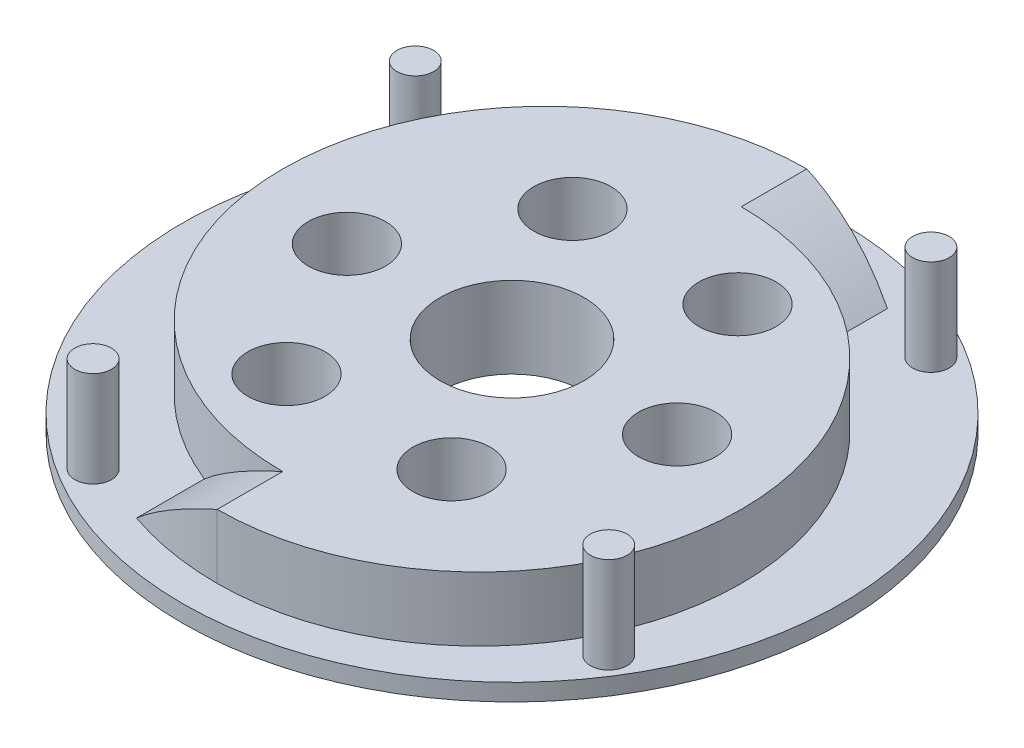
ISO-10303-21;
HEADER;
FILE_DESCRIPTION(('STEP AP214'),'2;1');
FILE_NAME('part.step','',(''),(''),'','','');
FILE_SCHEMA(('AUTOMOTIVE_DESIGN { 1 0 10303 214 1 1 1 1 }'));
ENDSEC;
DATA;
#1=APPLICATION_CONTEXT('core data for automotive mechanical design processes');
#2=APPLICATION_PROTOCOL_DEFINITION('international standard','automotive_design',2000,#1);
#3=PRODUCT_CONTEXT('',#1,'mechanical');
#4=PRODUCT('Part','Part','',(#3));
#5=PRODUCT_RELATED_PRODUCT_CATEGORY('part','',(#4));
#6=PRODUCT_DEFINITION_FORMATION('','',#4);
#7=PRODUCT_DEFINITION_CONTEXT('part definition',#1,'design');
#8=PRODUCT_DEFINITION('design','',#6,#7);
#9=PRODUCT_DEFINITION_SHAPE('','',#8);
#10=(LENGTH_UNIT() NAMED_UNIT(*) SI_UNIT(.MILLI.,.METRE.));
#11=(NAMED_UNIT(*) PLANE_ANGLE_UNIT() SI_UNIT($,.RADIAN.));
#12=(NAMED_UNIT(*) SI_UNIT($,.STERADIAN.) SOLID_ANGLE_UNIT());
#13=UNCERTAINTY_MEASURE_WITH_UNIT(LENGTH_MEASURE(1.E-05),#10,'distance_accuracy_value','');
#14=(GEOMETRIC_REPRESENTATION_CONTEXT(3) GLOBAL_UNCERTAINTY_ASSIGNED_CONTEXT((#13)) GLOBAL_UNIT_ASSIGNED_CONTEXT((#10,
#11,#12)) REPRESENTATION_CONTEXT('',''));
#15=CARTESIAN_POINT('',(0.,0.,0.));
#16=DIRECTION('',(0.,0.,1.));
#17=DIRECTION('',(1.,0.,0.));
#18=AXIS2_PLACEMENT_3D('',#15,#16,#17);
#19=CARTESIAN_POINT('',(0.,3.302,0.));
#20=DIRECTION('',(0.,1.,0.));
#21=DIRECTION('',(0.,0.,1.));
#22=AXIS2_PLACEMENT_3D('',#19,#20,#21);
#23=PLANE('',#22);
#24=CARTESIAN_POINT('',(-31.2270824027338,3.302,49.9737782103062));
#25=DIRECTION('',(0.,1.,0.));
#26=DIRECTION('',(0.,0.,1.));
#27=AXIS2_PLACEMENT_3D('',#24,#25,#26);
#28=CIRCLE('',#27,3.556);
#29=CARTESIAN_POINT('',(-31.2270824027338,3.302,53.5297782103062));
#30=VERTEX_POINT('',#29);
#31=EDGE_CURVE('E11',#30,#30,#28,.T.);
#32=ORIENTED_EDGE('',*,*,#31,.F.);
#33=EDGE_LOOP('',(#32));
#34=FACE_BOUND('',#33,.T.);
#35=CARTESIAN_POINT('',(-49.973778210306,3.302,-31.227082402734));
#36=DIRECTION('',(0.,1.,0.));
#37=DIRECTION('',(0.,0.,1.));
#38=AXIS2_PLACEMENT_3D('',#35,#36,#37);
#39=CIRCLE('',#38,3.556);
#40=CARTESIAN_POINT('',(-49.973778210306,3.302,-27.671082402734));
#41=VERTEX_POINT('',#40);
#42=EDGE_CURVE('E36',#41,#41,#39,.T.);
#43=ORIENTED_EDGE('',*,*,#42,.F.);
#44=EDGE_LOOP('',(#43));
#45=FACE_BOUND('',#44,.T.);
#46=CARTESIAN_POINT('',(31.2270824027342,3.302,-49.9737782103059));
#47=DIRECTION('',(0.,1.,0.));
#48=DIRECTION('',(0.,0.,1.));
#49=AXIS2_PLACEMENT_3D('',#46,#47,#48);
#50=CIRCLE('',#49,3.556);
#51=CARTESIAN_POINT('',(31.2270824027342,3.302,-46.4177782103059));
#52=VERTEX_POINT('',#51);
#53=EDGE_CURVE('E120',#52,#52,#50,.T.);
#54=ORIENTED_EDGE('',*,*,#53,.F.);
#55=EDGE_LOOP('',(#54));
#56=FACE_BOUND('',#55,.T.);
#57=CARTESIAN_POINT('',(49.9737782103058,3.302,31.2270824027344));
#58=DIRECTION('',(0.,1.,0.));
#59=DIRECTION('',(0.,0.,1.));
#60=AXIS2_PLACEMENT_3D('',#57,#58,#59);
#61=CIRCLE('',#60,3.556);
#62=CARTESIAN_POINT('',(49.9737782103058,3.302,34.7830824027344));
#63=VERTEX_POINT('',#62);
#64=EDGE_CURVE('E117',#63,#63,#61,.T.);
#65=ORIENTED_EDGE('',*,*,#64,.F.);
#66=EDGE_LOOP('',(#65));
#67=FACE_BOUND('',#66,.T.);
#68=CARTESIAN_POINT('',(0.,3.302,0.));
#69=DIRECTION('',(0.,1.,0.));
#70=DIRECTION('',(0.,0.,1.));
#71=AXIS2_PLACEMENT_3D('',#68,#69,#70);
#72=CIRCLE('',#71,63.881);
#73=CARTESIAN_POINT('',(0.,3.302,63.881));
#74=VERTEX_POINT('',#73);
#75=EDGE_CURVE('E114',#74,#74,#72,.T.);
#76=ORIENTED_EDGE('',*,*,#75,.T.);
#77=EDGE_LOOP('',(#76));
#78=FACE_BOUND('',#77,.T.);
#79=CARTESIAN_POINT('',(0.,3.302,-6.35));
#80=DIRECTION('',(0.,1.,0.));
#81=DIRECTION('',(0.,0.,1.));
#82=AXIS2_PLACEMENT_3D('',#79,#80,#81);
#83=CIRCLE('',#82,50.8);
#84=CARTESIAN_POINT('',(0.,3.302,-57.15));
#85=VERTEX_POINT('',#84);
#86=CARTESIAN_POINT('',(-18.796,3.302,40.8448131048318));
#87=VERTEX_POINT('',#86);
#88=EDGE_CURVE('E137',#85,#87,#83,.T.);
#89=ORIENTED_EDGE('',*,*,#88,.F.);
#90=CARTESIAN_POINT('',(0.,3.302,0.));
#91=DIRECTION('',(0.,-1.,0.));
#92=DIRECTION('',(0.,0.,-1.));
#93=AXIS2_PLACEMENT_3D('',#90,#91,#92);
#94=CIRCLE('',#93,57.15);
#95=CARTESIAN_POINT('',(18.796,3.302,-53.9706668848922));
#96=VERTEX_POINT('',#95);
#97=EDGE_CURVE('E79',#85,#96,#94,.T.);
#98=ORIENTED_EDGE('',*,*,#97,.T.);
#99=DIRECTION('',(0.,0.,-1.));
#100=VECTOR('',#99,1.);
#101=CARTESIAN_POINT('',(18.796,3.302,500000.));
#102=LINE('',#101,#100);
#103=CARTESIAN_POINT('',(18.796,3.302,-40.8448131047408));
#104=VERTEX_POINT('',#103);
#105=EDGE_CURVE('E94',#104,#96,#102,.T.);
#106=ORIENTED_EDGE('',*,*,#105,.F.);
#107=CARTESIAN_POINT('',(0.,3.302,6.35));
#108=DIRECTION('',(0.,1.,0.));
#109=DIRECTION('',(0.,0.,-1.));
#110=AXIS2_PLACEMENT_3D('',#107,#108,#109);
#111=CIRCLE('',#110,50.8);
#112=CARTESIAN_POINT('',(0.,3.302,57.15));
#113=VERTEX_POINT('',#112);
#114=EDGE_CURVE('E140',#113,#104,#111,.T.);
#115=ORIENTED_EDGE('',*,*,#114,.F.);
#116=CARTESIAN_POINT('',(0.,3.302,0.));
#117=DIRECTION('',(0.,-1.,0.));
#118=DIRECTION('',(0.,0.,-1.));
#119=AXIS2_PLACEMENT_3D('',#116,#117,#118);
#120=CIRCLE('',#119,57.15);
#121=CARTESIAN_POINT('',(-18.796,3.302,53.9706668848922));
#122=VERTEX_POINT('',#121);
#123=EDGE_CURVE('E457',#113,#122,#120,.T.);
#124=ORIENTED_EDGE('',*,*,#123,.T.);
#125=DIRECTION('',(0.,0.,1.));
#126=VECTOR('',#125,1.);
#127=CARTESIAN_POINT('',(-18.796,3.302,-500000.));
#128=LINE('',#127,#126);
#129=EDGE_CURVE('E139',#87,#122,#128,.T.);
#130=ORIENTED_EDGE('',*,*,#129,.F.);
#131=EDGE_LOOP('',(#89,#98,#106,#115,#124,#130));
#132=FACE_BOUND('',#131,.T.);
#133=ADVANCED_FACE('F28',(#34,#45,#56,#67,#78,#132),#23,.T.);
#134=CARTESIAN_POINT('',(0.,15.748,6.35));
#135=DIRECTION('',(0.,-1.,0.));
#136=DIRECTION('',(0.,0.,-1.));
#137=AXIS2_PLACEMENT_3D('',#134,#135,#136);
#138=CYLINDRICAL_SURFACE('',#137,50.8);
#139=CARTESIAN_POINT('',(18.796,3.30199999999998,-40.8448131048341));
#140=CARTESIAN_POINT('',(18.2499838030697,3.80290036927987,-41.0622676621294));
#141=CARTESIAN_POINT('',(17.6946825832998,4.29677530294781,-41.2724487283464));
#142=CARTESIAN_POINT('',(16.5655796926331,5.26987176526841,-41.6768817912258));
#143=CARTESIAN_POINT('',(15.9917749751288,5.74909085526093,-41.8711311458764));
#144=CARTESIAN_POINT('',(14.2409719123791,7.16524378908628,-42.4284441581954));
#145=CARTESIAN_POINT('',(13.0364723320051,8.0789376973108,-42.7653114886588));
#146=CARTESIAN_POINT('',(10.5817909368585,9.82050135849514,-43.351378626489));
#147=CARTESIAN_POINT('',(9.33290226544946,10.6496665204869,-43.602114598507));
#148=CARTESIAN_POINT('',(7.41524547617781,11.8374832005656,-43.9100550865913));
#149=CARTESIAN_POINT('',(6.7689124840152,12.223953691417,-44.0013179419339));
#150=CARTESIAN_POINT('',(5.46222807048258,12.9775636647793,-44.1597706939482));
#151=CARTESIAN_POINT('',(4.80187912739568,13.3447065254744,-44.2269648094769));
#152=CARTESIAN_POINT('',(3.79749786783912,13.8825221019915,-44.3089954512435));
#153=CARTESIAN_POINT('',(3.45821988871541,14.060721356319,-44.3333044375023));
#154=CARTESIAN_POINT('',(2.77655063705579,14.4118225392987,-44.3752141223084));
#155=CARTESIAN_POINT('',(2.43415964015981,14.5847249311467,-44.3928154089741));
#156=CARTESIAN_POINT('',(1.74477768779582,14.9259495463659,-44.4212057186202));
#157=CARTESIAN_POINT('',(1.39777255614699,15.0942458719888,-44.431961716357));
#158=CARTESIAN_POINT('',(0.700942837196339,15.4253045361365,-44.4463597587756));
#159=CARTESIAN_POINT('',(0.351117963857075,15.5880663042635,-44.4500010723802));
#160=CARTESIAN_POINT('',(0.,15.748,-44.45));
#161=B_SPLINE_CURVE_WITH_KNOTS('',3,(#139,#140,#141,#142,#143,#144,#145,#146,#147,#148,#149,
#150,#151,#152,#153,#154,#155,#156,#157,#158,#159,#160),.UNSPECIFIED.,.F.,.F.,(4,2,2,2,2,2,2,2,
2,2,4),(0.,2.31643178965832,4.63324694787775,9.27488130712018,13.8288147401194,16.1039223004652,
18.3786308762437,19.5305421208204,20.6823523447338,21.8396781977135,22.9971229667259),.UNSPECIFIED.);
#162=CARTESIAN_POINT('',(0.,15.748,-44.4500000000024));
#163=VERTEX_POINT('',#162);
#164=EDGE_CURVE('E95',#104,#163,#161,.T.);
#165=ORIENTED_EDGE('',*,*,#164,.T.);
#166=CARTESIAN_POINT('',(0.,15.748,6.35));
#167=DIRECTION('',(0.,1.,0.));
#168=DIRECTION('',(0.,0.,-1.));
#169=AXIS2_PLACEMENT_3D('',#166,#167,#168);
#170=CIRCLE('',#169,50.8);
#171=CARTESIAN_POINT('',(0.,15.748,57.15));
#172=VERTEX_POINT('',#171);
#173=EDGE_CURVE('E103',#172,#163,#170,.T.);
#174=ORIENTED_EDGE('',*,*,#173,.F.);
#175=DIRECTION('',(0.,-1.,0.));
#176=VECTOR('',#175,1.);
#177=CARTESIAN_POINT('',(0.,15.748,57.15));
#178=LINE('',#177,#176);
#179=EDGE_CURVE('E85',#172,#113,#178,.T.);
#180=ORIENTED_EDGE('',*,*,#179,.T.);
#181=ORIENTED_EDGE('',*,*,#114,.T.);
#182=EDGE_LOOP('',(#165,#174,#180,#181));
#183=FACE_BOUND('',#182,.T.);
#184=ADVANCED_FACE('F129',(#183),#138,.T.);
#185=CARTESIAN_POINT('',(0.,3.302,0.));
#186=DIRECTION('',(0.,-1.,0.));
#187=DIRECTION('',(0.,0.,-1.));
#188=AXIS2_PLACEMENT_3D('',#185,#186,#187);
#189=CYLINDRICAL_SURFACE('',#188,63.881);
#190=ORIENTED_EDGE('',*,*,#75,.F.);
#191=EDGE_LOOP('',(#190));
#192=FACE_BOUND('',#191,.T.);
#193=CARTESIAN_POINT('',(0.,0.,0.));
#194=DIRECTION('',(0.,1.,0.));
#195=DIRECTION('',(0.,0.,1.));
#196=AXIS2_PLACEMENT_3D('',#193,#194,#195);
#197=CIRCLE('',#196,63.881);
#198=CARTESIAN_POINT('',(0.,0.,63.881));
#199=VERTEX_POINT('',#198);
#200=EDGE_CURVE('E84',#199,#199,#197,.T.);
#201=ORIENTED_EDGE('',*,*,#200,.T.);
#202=EDGE_LOOP('',(#201));
#203=FACE_BOUND('',#202,.T.);
#204=ADVANCED_FACE('F30',(#192,#203),#189,.T.);
#205=CARTESIAN_POINT('',(0.,0.,0.));
#206=DIRECTION('',(0.,1.,0.));
#207=DIRECTION('',(0.,0.,1.));
#208=AXIS2_PLACEMENT_3D('',#205,#206,#207);
#209=PLANE('',#208);
#210=CARTESIAN_POINT('',(16.0020000000003,0.,27.716277022717));
#211=DIRECTION('',(0.,1.,0.));
#212=DIRECTION('',(-0.866025403784433,0.,0.50000000000001));
#213=AXIS2_PLACEMENT_3D('',#210,#211,#212);
#214=CIRCLE('',#213,7.493);
#215=CARTESIAN_POINT('',(9.51287164944357,0.,31.4627770227171));
#216=VERTEX_POINT('',#215);
#217=EDGE_CURVE('E181',#216,#216,#214,.T.);
#218=ORIENTED_EDGE('',*,*,#217,.T.);
#219=EDGE_LOOP('',(#218));
#220=FACE_BOUND('',#219,.T.);
#221=CARTESIAN_POINT('',(-16.0019999999997,0.,27.7162770227173));
#222=DIRECTION('',(0.,1.,0.));
#223=DIRECTION('',(-0.866025403784443,0.,-0.499999999999992));
#224=AXIS2_PLACEMENT_3D('',#221,#222,#223);
#225=CIRCLE('',#224,7.493);
#226=CARTESIAN_POINT('',(-22.4911283505566,0.,23.9697770227174));
#227=VERTEX_POINT('',#226);
#228=EDGE_CURVE('E175',#227,#227,#225,.T.);
#229=ORIENTED_EDGE('',*,*,#228,.T.);
#230=EDGE_LOOP('',(#229));
#231=FACE_BOUND('',#230,.T.);
#232=CARTESIAN_POINT('',(-32.004,0.,2.23482866977889E-13));
#233=DIRECTION('',(0.,1.,0.));
#234=DIRECTION('',(0.,0.,-1.));
#235=AXIS2_PLACEMENT_3D('',#232,#233,#234);
#236=CIRCLE('',#235,7.493);
#237=CARTESIAN_POINT('',(-32.0040000000001,0.,-7.49299999999978));
#238=VERTEX_POINT('',#237);
#239=EDGE_CURVE('E169',#238,#238,#236,.T.);
#240=ORIENTED_EDGE('',*,*,#239,.T.);
#241=EDGE_LOOP('',(#240));
#242=FACE_BOUND('',#241,.T.);
#243=CARTESIAN_POINT('',(-16.0020000000001,0.,-27.7162770227171));
#244=DIRECTION('',(0.,1.,0.));
#245=DIRECTION('',(0.866025403784436,0.,-0.500000000000004));
#246=AXIS2_PLACEMENT_3D('',#243,#244,#245);
#247=CIRCLE('',#246,7.493);
#248=CARTESIAN_POINT('',(-9.51287164944335,0.,-31.4627770227171));
#249=VERTEX_POINT('',#248);
#250=EDGE_CURVE('E163',#249,#249,#247,.T.);
#251=ORIENTED_EDGE('',*,*,#250,.T.);
#252=EDGE_LOOP('',(#251));
#253=FACE_BOUND('',#252,.T.);
#254=CARTESIAN_POINT('',(16.0019999999999,0.,-27.7162770227172));
#255=DIRECTION('',(0.,1.,0.));
#256=DIRECTION('',(0.86602540378444,0.,0.499999999999998));
#257=AXIS2_PLACEMENT_3D('',#254,#255,#256);
#258=CIRCLE('',#257,7.493);
#259=CARTESIAN_POINT('',(22.4911283505567,0.,-23.9697770227172));
#260=VERTEX_POINT('',#259);
#261=EDGE_CURVE('E157',#260,#260,#258,.T.);
#262=ORIENTED_EDGE('',*,*,#261,.T.);
#263=EDGE_LOOP('',(#262));
#264=FACE_BOUND('',#263,.T.);
#265=CARTESIAN_POINT('',(32.004,0.,0.));
#266=DIRECTION('',(0.,1.,0.));
#267=DIRECTION('',(0.,0.,1.));
#268=AXIS2_PLACEMENT_3D('',#265,#266,#267);
#269=CIRCLE('',#268,7.493);
#270=CARTESIAN_POINT('',(32.004,0.,7.493));
#271=VERTEX_POINT('',#270);
#272=EDGE_CURVE('E151',#271,#271,#269,.T.);
#273=ORIENTED_EDGE('',*,*,#272,.T.);
#274=EDGE_LOOP('',(#273));
#275=FACE_BOUND('',#274,.T.);
#276=CARTESIAN_POINT('',(0.,0.,0.));
#277=DIRECTION('',(0.,1.,0.));
#278=DIRECTION('',(0.,0.,1.));
#279=AXIS2_PLACEMENT_3D('',#276,#277,#278);
#280=CIRCLE('',#279,13.97);
#281=CARTESIAN_POINT('',(0.,0.,13.97));
#282=VERTEX_POINT('',#281);
#283=EDGE_CURVE('E143',#282,#282,#280,.T.);
#284=ORIENTED_EDGE('',*,*,#283,.T.);
#285=EDGE_LOOP('',(#284));
#286=FACE_BOUND('',#285,.T.);
#287=ORIENTED_EDGE('',*,*,#200,.F.);
#288=EDGE_LOOP('',(#287));
#289=FACE_BOUND('',#288,.T.);
#290=ADVANCED_FACE('F335',(#220,#231,#242,#253,#264,#275,#286,#289),#209,.F.);
#291=CARTESIAN_POINT('',(0.,15.748,-6.35));
#292=DIRECTION('',(0.,-1.,0.));
#293=DIRECTION('',(0.,0.,-1.));
#294=AXIS2_PLACEMENT_3D('',#291,#292,#293);
#295=CYLINDRICAL_SURFACE('',#294,50.8);
#296=ORIENTED_EDGE('',*,*,#88,.T.);
#297=CARTESIAN_POINT('',(0.,15.748,44.4500000000024));
#298=CARTESIAN_POINT('',(-0.703409607449954,15.4276220164894,44.4500153817528));
#299=CARTESIAN_POINT('',(-1.40157330759739,15.0958798844978,44.4353911843303));
#300=CARTESIAN_POINT('',(-2.78582104019797,14.4106083828221,44.3782814354838));
#301=CARTESIAN_POINT('',(-3.47190721001198,14.0570829189982,44.3358008657516));
#302=CARTESIAN_POINT('',(-4.83004364602304,13.3294033248621,44.2244460832493));
#303=CARTESIAN_POINT('',(-5.50210616782634,12.9552683443915,44.1555960296412));
#304=CARTESIAN_POINT('',(-6.83161360669136,12.1870311557749,43.9930001754333));
#305=CARTESIAN_POINT('',(-7.48905801808855,11.792928258447,43.8992535150664));
#306=CARTESIAN_POINT('',(-9.41686403373734,10.5951287586065,43.5863474289719));
#307=CARTESIAN_POINT('',(-10.664952520106,9.76398073656176,43.3335918834064));
#308=CARTESIAN_POINT('',(-13.0942693416444,8.03527546139636,42.7492982159364));
#309=CARTESIAN_POINT('',(-14.2755104286141,7.13773094994271,42.4177751828581));
#310=CARTESIAN_POINT('',(-15.7111103901225,5.97599875409242,41.9603873601064));
#311=CARTESIAN_POINT('',(-15.9986004689075,5.73962149691291,41.8659255638805));
#312=CARTESIAN_POINT('',(-16.5690110012921,5.26317391238849,41.672895517532));
#313=CARTESIAN_POINT('',(-16.8519324737054,5.02310443240312,41.5743282010051));
#314=CARTESIAN_POINT('',(-17.4143950369757,4.53831516866202,41.3728296268689));
#315=CARTESIAN_POINT('',(-17.693917020671,4.29358012566647,41.2698818293479));
#316=CARTESIAN_POINT('',(-18.2484010510822,3.80047897643053,41.0601648487031));
#317=CARTESIAN_POINT('',(-18.5233621159153,3.55211210943384,40.9533948579623));
#318=CARTESIAN_POINT('',(-18.7959999999996,3.30200000000035,40.8448131048319));
#319=B_SPLINE_CURVE_WITH_KNOTS('',3,(#297,#298,#299,#300,#301,#302,#303,#304,#305,#306,#307,
#308,#309,#310,#311,#312,#313,#314,#315,#316,#317,#318),.UNSPECIFIED.,.F.,.F.,(4,2,2,2,2,2,2,2,
2,2,4),(0.,2.31846726597696,4.63652002211274,6.95245408818673,9.26846814199361,13.8247533568958,
18.3801664652178,19.5321062517174,20.6837855020291,21.840285554639,22.9970314312767),.UNSPECIFIED.);
#320=CARTESIAN_POINT('',(0.,15.748,44.4500000000024));
#321=VERTEX_POINT('',#320);
#322=EDGE_CURVE('E43',#321,#87,#319,.T.);
#323=ORIENTED_EDGE('',*,*,#322,.F.);
#324=CARTESIAN_POINT('',(0.,15.748,-6.35));
#325=DIRECTION('',(0.,1.,0.));
#326=DIRECTION('',(0.,0.,1.));
#327=AXIS2_PLACEMENT_3D('',#324,#325,#326);
#328=CIRCLE('',#327,50.8);
#329=CARTESIAN_POINT('',(0.,15.748,-57.15));
#330=VERTEX_POINT('',#329);
#331=EDGE_CURVE('E101',#330,#321,#328,.T.);
#332=ORIENTED_EDGE('',*,*,#331,.F.);
#333=DIRECTION('',(0.,-1.,0.));
#334=VECTOR('',#333,1.);
#335=CARTESIAN_POINT('',(0.,15.748,-57.15));
#336=LINE('',#335,#334);
#337=EDGE_CURVE('E74',#330,#85,#336,.T.);
#338=ORIENTED_EDGE('',*,*,#337,.T.);
#339=EDGE_LOOP('',(#296,#323,#332,#338));
#340=FACE_BOUND('',#339,.T.);
#341=ADVANCED_FACE('F105',(#340),#295,.T.);
#342=CARTESIAN_POINT('',(0.,15.748,6.35));
#343=DIRECTION('',(0.,-1.,0.));
#344=DIRECTION('',(0.,0.,-1.));
#345=AXIS2_PLACEMENT_3D('',#342,#343,#344);
#346=PLANE('',#345);
#347=CARTESIAN_POINT('',(16.0020000000003,15.748,27.716277022717));
#348=DIRECTION('',(0.,1.,0.));
#349=DIRECTION('',(-0.866025403784433,0.,0.50000000000001));
#350=AXIS2_PLACEMENT_3D('',#347,#348,#349);
#351=CIRCLE('',#350,7.493);
#352=CARTESIAN_POINT('',(9.51287164944357,15.748,31.4627770227171));
#353=VERTEX_POINT('',#352);
#354=EDGE_CURVE('E184',#353,#353,#351,.T.);
#355=ORIENTED_EDGE('',*,*,#354,.F.);
#356=EDGE_LOOP('',(#355));
#357=FACE_BOUND('',#356,.T.);
#358=CARTESIAN_POINT('',(-16.0019999999997,15.748,27.7162770227173));
#359=DIRECTION('',(0.,1.,0.));
#360=DIRECTION('',(-0.866025403784443,0.,-0.499999999999992));
#361=AXIS2_PLACEMENT_3D('',#358,#359,#360);
#362=CIRCLE('',#361,7.493);
#363=CARTESIAN_POINT('',(-22.4911283505566,15.748,23.9697770227174));
#364=VERTEX_POINT('',#363);
#365=EDGE_CURVE('E178',#364,#364,#362,.T.);
#366=ORIENTED_EDGE('',*,*,#365,.F.);
#367=EDGE_LOOP('',(#366));
#368=FACE_BOUND('',#367,.T.);
#369=CARTESIAN_POINT('',(-32.004,15.748,2.23482866977889E-13));
#370=DIRECTION('',(0.,1.,0.));
#371=DIRECTION('',(0.,0.,-1.));
#372=AXIS2_PLACEMENT_3D('',#369,#370,#371);
#373=CIRCLE('',#372,7.493);
#374=CARTESIAN_POINT('',(-32.0040000000001,15.748,-7.49299999999978));
#375=VERTEX_POINT('',#374);
#376=EDGE_CURVE('E172',#375,#375,#373,.T.);
#377=ORIENTED_EDGE('',*,*,#376,.F.);
#378=EDGE_LOOP('',(#377));
#379=FACE_BOUND('',#378,.T.);
#380=CARTESIAN_POINT('',(-16.0020000000001,15.748,-27.7162770227171));
#381=DIRECTION('',(0.,1.,0.));
#382=DIRECTION('',(0.866025403784436,0.,-0.500000000000004));
#383=AXIS2_PLACEMENT_3D('',#380,#381,#382);
#384=CIRCLE('',#383,7.493);
#385=CARTESIAN_POINT('',(-9.51287164944335,15.748,-31.4627770227171));
#386=VERTEX_POINT('',#385);
#387=EDGE_CURVE('E166',#386,#386,#384,.T.);
#388=ORIENTED_EDGE('',*,*,#387,.F.);
#389=EDGE_LOOP('',(#388));
#390=FACE_BOUND('',#389,.T.);
#391=CARTESIAN_POINT('',(16.0019999999999,15.748,-27.7162770227172));
#392=DIRECTION('',(0.,1.,0.));
#393=DIRECTION('',(0.86602540378444,0.,0.499999999999998));
#394=AXIS2_PLACEMENT_3D('',#391,#392,#393);
#395=CIRCLE('',#394,7.493);
#396=CARTESIAN_POINT('',(22.4911283505567,15.748,-23.9697770227172));
#397=VERTEX_POINT('',#396);
#398=EDGE_CURVE('E160',#397,#397,#395,.T.);
#399=ORIENTED_EDGE('',*,*,#398,.F.);
#400=EDGE_LOOP('',(#399));
#401=FACE_BOUND('',#400,.T.);
#402=CARTESIAN_POINT('',(32.004,15.748,0.));
#403=DIRECTION('',(0.,1.,0.));
#404=DIRECTION('',(0.,0.,1.));
#405=AXIS2_PLACEMENT_3D('',#402,#403,#404);
#406=CIRCLE('',#405,7.493);
#407=CARTESIAN_POINT('',(32.004,15.748,7.493));
#408=VERTEX_POINT('',#407);
#409=EDGE_CURVE('E154',#408,#408,#406,.T.);
#410=ORIENTED_EDGE('',*,*,#409,.F.);
#411=EDGE_LOOP('',(#410));
#412=FACE_BOUND('',#411,.T.);
#413=CARTESIAN_POINT('',(0.,15.748,0.));
#414=DIRECTION('',(0.,1.,0.));
#415=DIRECTION('',(0.,0.,1.));
#416=AXIS2_PLACEMENT_3D('',#413,#414,#415);
#417=CIRCLE('',#416,13.97);
#418=CARTESIAN_POINT('',(0.,15.748,13.97));
#419=VERTEX_POINT('',#418);
#420=EDGE_CURVE('E148',#419,#419,#417,.T.);
#421=ORIENTED_EDGE('',*,*,#420,.F.);
#422=EDGE_LOOP('',(#421));
#423=FACE_BOUND('',#422,.T.);
#424=ORIENTED_EDGE('',*,*,#173,.T.);
#425=DIRECTION('',(0.,0.,-1.));
#426=VECTOR('',#425,1.);
#427=CARTESIAN_POINT('',(0.,15.748,-57.15));
#428=LINE('',#427,#426);
#429=EDGE_CURVE('E91',#163,#330,#428,.T.);
#430=ORIENTED_EDGE('',*,*,#429,.T.);
#431=ORIENTED_EDGE('',*,*,#331,.T.);
#432=DIRECTION('',(0.,0.,1.));
#433=VECTOR('',#432,1.);
#434=CARTESIAN_POINT('',(0.,15.748,44.45));
#435=LINE('',#434,#433);
#436=EDGE_CURVE('E48',#321,#172,#435,.T.);
#437=ORIENTED_EDGE('',*,*,#436,.T.);
#438=EDGE_LOOP('',(#424,#430,#431,#437));
#439=FACE_BOUND('',#438,.T.);
#440=ADVANCED_FACE('F100',(#357,#368,#379,#390,#401,#412,#423,#439),#346,.F.);
#441=CARTESIAN_POINT('',(0.,0.,0.));
#442=DIRECTION('',(0.,1.,0.));
#443=DIRECTION('',(0.,0.,1.));
#444=AXIS2_PLACEMENT_3D('',#441,#442,#443);
#445=CYLINDRICAL_SURFACE('',#444,13.97);
#446=ORIENTED_EDGE('',*,*,#283,.F.);
#447=EDGE_LOOP('',(#446));
#448=FACE_BOUND('',#447,.T.);
#449=ORIENTED_EDGE('',*,*,#420,.T.);
#450=EDGE_LOOP('',(#449));
#451=FACE_BOUND('',#450,.T.);
#452=ADVANCED_FACE('F326',(#448,#451),#445,.F.);
#453=CARTESIAN_POINT('',(32.004,0.,0.));
#454=DIRECTION('',(0.,1.,0.));
#455=DIRECTION('',(0.,0.,1.));
#456=AXIS2_PLACEMENT_3D('',#453,#454,#455);
#457=CYLINDRICAL_SURFACE('',#456,7.493);
#458=ORIENTED_EDGE('',*,*,#272,.F.);
#459=EDGE_LOOP('',(#458));
#460=FACE_BOUND('',#459,.T.);
#461=ORIENTED_EDGE('',*,*,#409,.T.);
#462=EDGE_LOOP('',(#461));
#463=FACE_BOUND('',#462,.T.);
#464=ADVANCED_FACE('F392',(#460,#463),#457,.F.);
#465=CARTESIAN_POINT('',(16.0019999999999,0.,-27.7162770227172));
#466=DIRECTION('',(0.,1.,0.));
#467=DIRECTION('',(0.,0.,1.));
#468=AXIS2_PLACEMENT_3D('',#465,#466,#467);
#469=CYLINDRICAL_SURFACE('',#468,7.493);
#470=ORIENTED_EDGE('',*,*,#261,.F.);
#471=EDGE_LOOP('',(#470));
#472=FACE_BOUND('',#471,.T.);
#473=ORIENTED_EDGE('',*,*,#398,.T.);
#474=EDGE_LOOP('',(#473));
#475=FACE_BOUND('',#474,.T.);
#476=ADVANCED_FACE('F384',(#472,#475),#469,.F.);
#477=CARTESIAN_POINT('',(-16.0020000000001,0.,-27.7162770227171));
#478=DIRECTION('',(0.,1.,0.));
#479=DIRECTION('',(0.,0.,1.));
#480=AXIS2_PLACEMENT_3D('',#477,#478,#479);
#481=CYLINDRICAL_SURFACE('',#480,7.493);
#482=ORIENTED_EDGE('',*,*,#250,.F.);
#483=EDGE_LOOP('',(#482));
#484=FACE_BOUND('',#483,.T.);
#485=ORIENTED_EDGE('',*,*,#387,.T.);
#486=EDGE_LOOP('',(#485));
#487=FACE_BOUND('',#486,.T.);
#488=ADVANCED_FACE('F376',(#484,#487),#481,.F.);
#489=CARTESIAN_POINT('',(-32.004,0.,2.23482866977889E-13));
#490=DIRECTION('',(0.,1.,0.));
#491=DIRECTION('',(0.,0.,1.));
#492=AXIS2_PLACEMENT_3D('',#489,#490,#491);
#493=CYLINDRICAL_SURFACE('',#492,7.493);
#494=ORIENTED_EDGE('',*,*,#239,.F.);
#495=EDGE_LOOP('',(#494));
#496=FACE_BOUND('',#495,.T.);
#497=ORIENTED_EDGE('',*,*,#376,.T.);
#498=EDGE_LOOP('',(#497));
#499=FACE_BOUND('',#498,.T.);
#500=ADVANCED_FACE('F368',(#496,#499),#493,.F.);
#501=CARTESIAN_POINT('',(-16.0019999999997,0.,27.7162770227173));
#502=DIRECTION('',(0.,1.,0.));
#503=DIRECTION('',(0.,0.,1.));
#504=AXIS2_PLACEMENT_3D('',#501,#502,#503);
#505=CYLINDRICAL_SURFACE('',#504,7.493);
#506=ORIENTED_EDGE('',*,*,#228,.F.);
#507=EDGE_LOOP('',(#506));
#508=FACE_BOUND('',#507,.T.);
#509=ORIENTED_EDGE('',*,*,#365,.T.);
#510=EDGE_LOOP('',(#509));
#511=FACE_BOUND('',#510,.T.);
#512=ADVANCED_FACE('F361',(#508,#511),#505,.F.);
#513=CARTESIAN_POINT('',(16.0020000000003,0.,27.716277022717));
#514=DIRECTION('',(0.,1.,0.));
#515=DIRECTION('',(0.,0.,1.));
#516=AXIS2_PLACEMENT_3D('',#513,#514,#515);
#517=CYLINDRICAL_SURFACE('',#516,7.493);
#518=ORIENTED_EDGE('',*,*,#217,.F.);
#519=EDGE_LOOP('',(#518));
#520=FACE_BOUND('',#519,.T.);
#521=ORIENTED_EDGE('',*,*,#354,.T.);
#522=EDGE_LOOP('',(#521));
#523=FACE_BOUND('',#522,.T.);
#524=ADVANCED_FACE('F355',(#520,#523),#517,.F.);
#525=CARTESIAN_POINT('',(29.7969212590886,-49.6673300647461,-500000.));
#526=DIRECTION('',(0.,0.,1.));
#527=DIRECTION('',(1.,0.,0.));
#528=AXIS2_PLACEMENT_3D('',#525,#526,#527);
#529=CYLINDRICAL_SURFACE('',#528,71.882);
#530=CARTESIAN_POINT('',(0.,15.748,57.15));
#531=CARTESIAN_POINT('',(-0.738305875458021,15.4117265015785,57.1500166829247));
#532=CARTESIAN_POINT('',(-1.47084208218775,15.0629347176847,57.1356939604539));
#533=CARTESIAN_POINT('',(-2.92275798965586,14.3412683104571,57.079831598076));
#534=CARTESIAN_POINT('',(-3.64213982830711,13.968397645993,57.0382964220193));
#535=CARTESIAN_POINT('',(-5.0658345593863,13.1997070298722,56.9295112350509));
#536=CARTESIAN_POINT('',(-5.7701584338105,12.8039046427104,56.8622806901839));
#537=CARTESIAN_POINT('',(-7.16302730210321,11.9900695900669,56.7036592158059));
#538=CARTESIAN_POINT('',(-7.85157182016865,11.5720362555029,56.6122675587913));
#539=CARTESIAN_POINT('',(-9.87101212607481,10.2991764017997,56.3073661359278));
#540=CARTESIAN_POINT('',(-11.1778597383691,9.41359815752516,56.0613347486502));
#541=CARTESIAN_POINT('',(-13.7194574362768,7.56739684789449,55.4940936165265));
#542=CARTESIAN_POINT('',(-14.9542274779471,6.60679472819637,55.1729048049914));
#543=CARTESIAN_POINT('',(-16.3763549491265,5.42474374087173,54.7539298120115));
#544=CARTESIAN_POINT('',(-16.6005635824873,5.23604940264527,54.6863619240743));
#545=CARTESIAN_POINT('',(-17.0462443274034,4.85629263717509,54.5490824952248));
#546=CARTESIAN_POINT('',(-17.2677169200653,4.66523063844713,54.4793713389289));
#547=CARTESIAN_POINT('',(-17.7085879743685,4.28018549336667,54.3376682110673));
#548=CARTESIAN_POINT('',(-17.9279783690591,4.08619538126846,54.2656701062086));
#549=CARTESIAN_POINT('',(-18.364041326794,3.69585244590387,54.1196578048947));
#550=CARTESIAN_POINT('',(-18.580713413753,3.49949922024147,54.0456432622851));
#551=CARTESIAN_POINT('',(-18.796,3.30199999999999,53.9706668848922));
#552=B_SPLINE_CURVE_WITH_KNOTS('',3,(#530,#531,#532,#533,#534,#535,#536,#537,#538,#539,#540,
#541,#542,#543,#544,#545,#546,#547,#548,#549,#550,#551),.UNSPECIFIED.,.F.,.F.,(4,2,2,2,2,2,2,2,
2,2,4),(0.,2.43350399166504,4.86660889843685,7.29787419942981,9.72921271541561,14.5164132263152,
19.302281960261,20.2044770659236,21.1065112039856,22.0112119165108,22.9160689266661),.UNSPECIFIED.);
#553=EDGE_CURVE('E194',#172,#122,#552,.T.);
#554=ORIENTED_EDGE('',*,*,#553,.F.);
#555=ORIENTED_EDGE('',*,*,#436,.F.);
#556=ORIENTED_EDGE('',*,*,#322,.T.);
#557=ORIENTED_EDGE('',*,*,#129,.T.);
#558=EDGE_LOOP('',(#554,#555,#556,#557));
#559=FACE_BOUND('',#558,.T.);
#560=ADVANCED_FACE('F200',(#559),#529,.T.);
#561=CARTESIAN_POINT('',(0.,3.302,0.));
#562=DIRECTION('',(0.,1.,0.));
#563=DIRECTION('',(0.,0.,1.));
#564=AXIS2_PLACEMENT_3D('',#561,#562,#563);
#565=CYLINDRICAL_SURFACE('',#564,57.15);
#566=ORIENTED_EDGE('',*,*,#553,.T.);
#567=ORIENTED_EDGE('',*,*,#123,.F.);
#568=ORIENTED_EDGE('',*,*,#179,.F.);
#569=EDGE_LOOP('',(#566,#567,#568));
#570=FACE_BOUND('',#569,.T.);
#571=ADVANCED_FACE('F204',(#570),#565,.T.);
#572=CARTESIAN_POINT('',(-29.7969212590886,-49.6673300647461,500000.));
#573=DIRECTION('',(0.,0.,-1.));
#574=DIRECTION('',(-1.,0.,0.));
#575=AXIS2_PLACEMENT_3D('',#572,#573,#574);
#576=CYLINDRICAL_SURFACE('',#575,71.882);
#577=ORIENTED_EDGE('',*,*,#105,.T.);
#578=CARTESIAN_POINT('',(18.796,3.30199999999998,-53.9706668848922));
#579=CARTESIAN_POINT('',(18.2175119148863,3.83269797948766,-54.1721355177472));
#580=CARTESIAN_POINT('',(17.6289814195383,4.35514540786818,-54.3666673465147));
#581=CARTESIAN_POINT('',(16.4321404584257,5.38280944883488,-54.7402984091564));
#582=CARTESIAN_POINT('',(15.8238268447123,5.88802329269661,-54.9193951702433));
#583=CARTESIAN_POINT('',(14.5867145273155,6.88127983939844,-55.2608615684968));
#584=CARTESIAN_POINT('',(13.9578784777089,7.36928744033547,-55.423198182572));
#585=CARTESIAN_POINT('',(12.6814253143824,8.32618836609664,-55.7291184530979));
#586=CARTESIAN_POINT('',(12.0338093147509,8.7950828208218,-55.8727032192001));
#587=CARTESIAN_POINT('',(10.7321950134797,9.70464731492954,-56.1371141668802));
#588=CARTESIAN_POINT('',(10.0785184122799,10.1456723153065,-56.258301694067));
#589=CARTESIAN_POINT('',(8.75447194425172,11.0075075277276,-56.4794846698373));
#590=CARTESIAN_POINT('',(8.08410256247972,11.4283183261146,-56.5794807333981));
#591=CARTESIAN_POINT('',(6.72832365169747,12.2483822797625,-56.7566654430285));
#592=CARTESIAN_POINT('',(6.04293065285102,12.6476576052559,-56.8338779251666));
#593=CARTESIAN_POINT('',(4.65762258688185,13.4241638405604,-56.9641368220814));
#594=CARTESIAN_POINT('',(3.95771028580175,13.8013988978952,-57.0171877964063));
#595=CARTESIAN_POINT('',(2.98431137715467,14.3053445232551,-57.072654443209));
#596=CARTESIAN_POINT('',(2.71647163901611,14.4418864748353,-57.0860372836175));
#597=CARTESIAN_POINT('',(2.1789869270368,14.7116541834119,-57.1090785726677));
#598=CARTESIAN_POINT('',(1.90934208985575,14.8448801879269,-57.1187373000802));
#599=CARTESIAN_POINT('',(1.36739493770054,15.1084248017578,-57.1342845221404));
#600=CARTESIAN_POINT('',(1.09508670822605,15.2387320035338,-57.1401601041456));
#601=CARTESIAN_POINT('',(0.548782611461077,15.4959368606539,-57.1480181719218));
#602=CARTESIAN_POINT('',(0.27478661156144,15.6228342437755,-57.1500003477685));
#603=CARTESIAN_POINT('',(0.,15.748,-57.15));
#604=B_SPLINE_CURVE_WITH_KNOTS('',3,(#578,#579,#580,#581,#582,#583,#584,#585,#586,#587,#588,
#589,#590,#591,#592,#593,#594,#595,#596,#597,#598,#599,#600,#601,#602,#603),.UNSPECIFIED.,.F.,
.F.,(4,2,2,2,2,2,2,2,2,2,2,2,4),(0.,2.43136849252554,4.86312578310178,7.29958650381674,
9.73590298015381,12.1286131333433,14.5212538404523,16.9113824309148,19.3010597901628,
20.2038266853808,21.1065259902857,22.0122902830082,22.9181266737786),.UNSPECIFIED.);
#605=EDGE_CURVE('E77',#96,#330,#604,.T.);
#606=ORIENTED_EDGE('',*,*,#605,.T.);
#607=ORIENTED_EDGE('',*,*,#429,.F.);
#608=ORIENTED_EDGE('',*,*,#164,.F.);
#609=EDGE_LOOP('',(#577,#606,#607,#608));
#610=FACE_BOUND('',#609,.T.);
#611=ADVANCED_FACE('F90',(#610),#576,.T.);
#612=CARTESIAN_POINT('',(0.,3.302,0.));
#613=DIRECTION('',(0.,1.,0.));
#614=DIRECTION('',(0.,0.,1.));
#615=AXIS2_PLACEMENT_3D('',#612,#613,#614);
#616=CYLINDRICAL_SURFACE('',#615,57.15);
#617=ORIENTED_EDGE('',*,*,#97,.F.);
#618=ORIENTED_EDGE('',*,*,#337,.F.);
#619=ORIENTED_EDGE('',*,*,#605,.F.);
#620=EDGE_LOOP('',(#617,#618,#619));
#621=FACE_BOUND('',#620,.T.);
#622=ADVANCED_FACE('F76',(#621),#616,.T.);
#623=CARTESIAN_POINT('',(49.9737782103058,21.844,31.2270824027344));
#624=DIRECTION('',(0.,-1.,0.));
#625=DIRECTION('',(0.,0.,-1.));
#626=AXIS2_PLACEMENT_3D('',#623,#624,#625);
#627=CYLINDRICAL_SURFACE('',#626,3.556);
#628=CARTESIAN_POINT('',(49.9737782103058,21.844,31.2270824027344));
#629=DIRECTION('',(0.,-1.,0.));
#630=DIRECTION('',(1.,0.,0.));
#631=AXIS2_PLACEMENT_3D('',#628,#629,#630);
#632=CIRCLE('',#631,3.556);
#633=CARTESIAN_POINT('',(53.5297782103058,21.844,31.2270824027344));
#634=VERTEX_POINT('',#633);
#635=EDGE_CURVE('E270',#634,#634,#632,.T.);
#636=ORIENTED_EDGE('',*,*,#635,.T.);
#637=EDGE_LOOP('',(#636));
#638=FACE_BOUND('',#637,.T.);
#639=ORIENTED_EDGE('',*,*,#64,.T.);
#640=EDGE_LOOP('',(#639));
#641=FACE_BOUND('',#640,.T.);
#642=ADVANCED_FACE('F228',(#638,#641),#627,.T.);
#643=CARTESIAN_POINT('',(49.9737782103058,21.844,31.2270824027344));
#644=DIRECTION('',(0.,-1.,0.));
#645=DIRECTION('',(1.,0.,0.));
#646=AXIS2_PLACEMENT_3D('',#643,#644,#645);
#647=PLANE('',#646);
#648=ORIENTED_EDGE('',*,*,#635,.F.);
#649=EDGE_LOOP('',(#648));
#650=FACE_BOUND('',#649,.T.);
#651=ADVANCED_FACE('F231',(#650),#647,.F.);
#652=CARTESIAN_POINT('',(31.2270824027342,21.844,-49.9737782103059));
#653=DIRECTION('',(0.,-1.,0.));
#654=DIRECTION('',(0.,0.,-1.));
#655=AXIS2_PLACEMENT_3D('',#652,#653,#654);
#656=CYLINDRICAL_SURFACE('',#655,3.556);
#657=CARTESIAN_POINT('',(31.2270824027342,21.844,-49.9737782103059));
#658=DIRECTION('',(0.,-1.,0.));
#659=DIRECTION('',(0.,0.,-1.));
#660=AXIS2_PLACEMENT_3D('',#657,#658,#659);
#661=CIRCLE('',#660,3.556);
#662=CARTESIAN_POINT('',(31.2270824027342,21.844,-53.5297782103059));
#663=VERTEX_POINT('',#662);
#664=EDGE_CURVE('E266',#663,#663,#661,.T.);
#665=ORIENTED_EDGE('',*,*,#664,.T.);
#666=EDGE_LOOP('',(#665));
#667=FACE_BOUND('',#666,.T.);
#668=ORIENTED_EDGE('',*,*,#53,.T.);
#669=EDGE_LOOP('',(#668));
#670=FACE_BOUND('',#669,.T.);
#671=ADVANCED_FACE('F235',(#667,#670),#656,.T.);
#672=CARTESIAN_POINT('',(31.2270824027342,21.844,-49.9737782103059));
#673=DIRECTION('',(0.,-1.,0.));
#674=DIRECTION('',(0.,0.,-1.));
#675=AXIS2_PLACEMENT_3D('',#672,#673,#674);
#676=PLANE('',#675);
#677=ORIENTED_EDGE('',*,*,#664,.F.);
#678=EDGE_LOOP('',(#677));
#679=FACE_BOUND('',#678,.T.);
#680=ADVANCED_FACE('F239',(#679),#676,.F.);
#681=CARTESIAN_POINT('',(-49.973778210306,21.844,-31.227082402734));
#682=DIRECTION('',(0.,-1.,0.));
#683=DIRECTION('',(0.,0.,-1.));
#684=AXIS2_PLACEMENT_3D('',#681,#682,#683);
#685=CYLINDRICAL_SURFACE('',#684,3.556);
#686=CARTESIAN_POINT('',(-49.973778210306,21.844,-31.227082402734));
#687=DIRECTION('',(0.,-1.,0.));
#688=DIRECTION('',(-1.,0.,0.));
#689=AXIS2_PLACEMENT_3D('',#686,#687,#688);
#690=CIRCLE('',#689,3.556);
#691=CARTESIAN_POINT('',(-53.529778210306,21.844,-31.227082402734));
#692=VERTEX_POINT('',#691);
#693=EDGE_CURVE('E263',#692,#692,#690,.T.);
#694=ORIENTED_EDGE('',*,*,#693,.T.);
#695=EDGE_LOOP('',(#694));
#696=FACE_BOUND('',#695,.T.);
#697=ORIENTED_EDGE('',*,*,#42,.T.);
#698=EDGE_LOOP('',(#697));
#699=FACE_BOUND('',#698,.T.);
#700=ADVANCED_FACE('F125',(#696,#699),#685,.T.);
#701=CARTESIAN_POINT('',(-49.973778210306,21.844,-31.227082402734));
#702=DIRECTION('',(0.,-1.,0.));
#703=DIRECTION('',(-1.,0.,0.));
#704=AXIS2_PLACEMENT_3D('',#701,#702,#703);
#705=PLANE('',#704);
#706=ORIENTED_EDGE('',*,*,#693,.F.);
#707=EDGE_LOOP('',(#706));
#708=FACE_BOUND('',#707,.T.);
#709=ADVANCED_FACE('F246',(#708),#705,.F.);
#710=CARTESIAN_POINT('',(-31.2270824027338,21.844,49.9737782103062));
#711=DIRECTION('',(0.,-1.,0.));
#712=DIRECTION('',(0.,0.,-1.));
#713=AXIS2_PLACEMENT_3D('',#710,#711,#712);
#714=CYLINDRICAL_SURFACE('',#713,3.556);
#715=CARTESIAN_POINT('',(-31.2270824027338,21.844,49.9737782103062));
#716=DIRECTION('',(0.,-1.,0.));
#717=DIRECTION('',(0.,0.,1.));
#718=AXIS2_PLACEMENT_3D('',#715,#716,#717);
#719=CIRCLE('',#718,3.556);
#720=CARTESIAN_POINT('',(-31.2270824027338,21.844,53.5297782103062));
#721=VERTEX_POINT('',#720);
#722=EDGE_CURVE('E262',#721,#721,#719,.T.);
#723=ORIENTED_EDGE('',*,*,#722,.T.);
#724=EDGE_LOOP('',(#723));
#725=FACE_BOUND('',#724,.T.);
#726=ORIENTED_EDGE('',*,*,#31,.T.);
#727=EDGE_LOOP('',(#726));
#728=FACE_BOUND('',#727,.T.);
#729=ADVANCED_FACE('F250',(#725,#728),#714,.T.);
#730=CARTESIAN_POINT('',(-31.2270824027338,21.844,49.9737782103062));
#731=DIRECTION('',(0.,-1.,0.));
#732=DIRECTION('',(0.,0.,1.));
#733=AXIS2_PLACEMENT_3D('',#730,#731,#732);
#734=PLANE('',#733);
#735=ORIENTED_EDGE('',*,*,#722,.F.);
#736=EDGE_LOOP('',(#735));
#737=FACE_BOUND('',#736,.T.);
#738=ADVANCED_FACE('F254',(#737),#734,.F.);
#739=CLOSED_SHELL('',(#133,#184,#204,#290,#341,#440,#452,#464,#476,#488,#500,#512,#524,#560,
#571,#611,#622,#642,#651,#671,#680,#700,#709,#729,#738));
#740=MANIFOLD_SOLID_BREP('B2',#739);
#741=ADVANCED_BREP_SHAPE_REPRESENTATION('',(#18,#740),#14);
#742=SHAPE_DEFINITION_REPRESENTATION(#9,#741);
ENDSEC;
END-ISO-10303-21;
